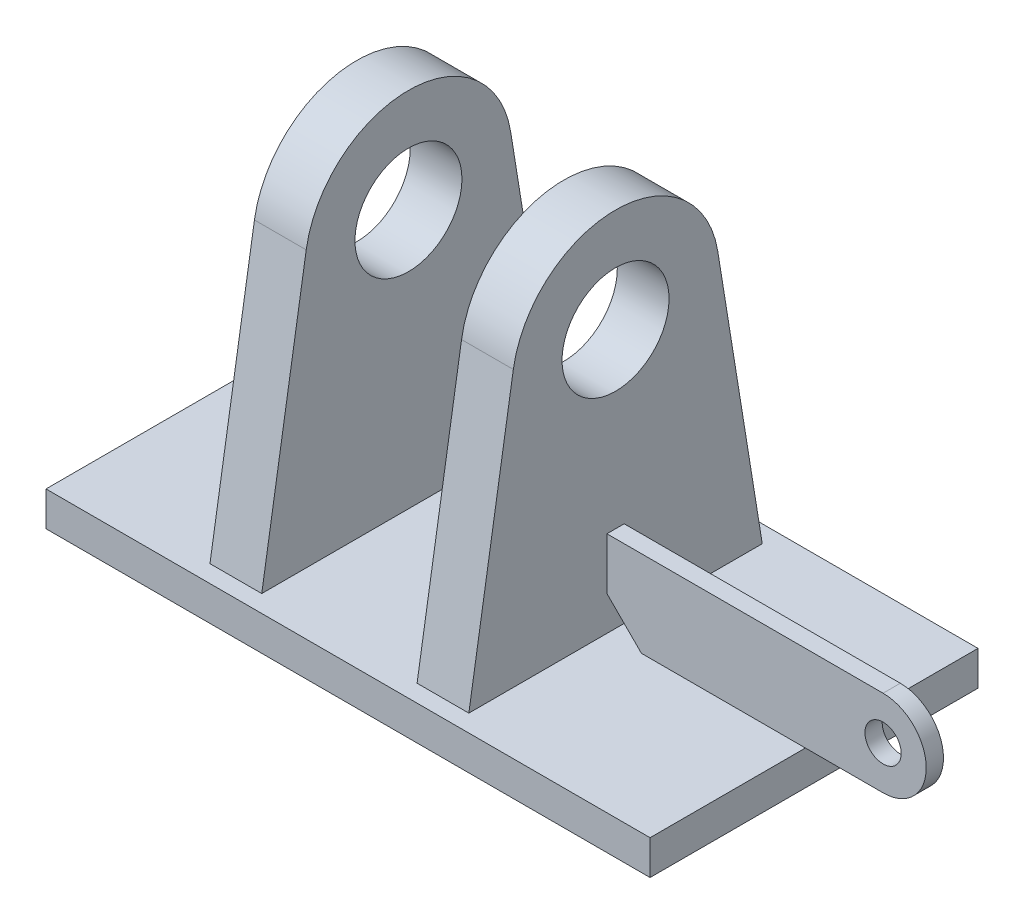
ISO-10303-21;
HEADER;
FILE_DESCRIPTION(('STEP AP214'),'2;1');
FILE_NAME('part.step','',(''),(''),'','','');
FILE_SCHEMA(('AUTOMOTIVE_DESIGN { 1 0 10303 214 1 1 1 1 }'));
ENDSEC;
DATA;
#1=APPLICATION_CONTEXT('core data for automotive mechanical design processes');
#2=APPLICATION_PROTOCOL_DEFINITION('international standard','automotive_design',2000,#1);
#3=PRODUCT_CONTEXT('',#1,'mechanical');
#4=PRODUCT('Part','Part','',(#3));
#5=PRODUCT_RELATED_PRODUCT_CATEGORY('part','',(#4));
#6=PRODUCT_DEFINITION_FORMATION('','',#4);
#7=PRODUCT_DEFINITION_CONTEXT('part definition',#1,'design');
#8=PRODUCT_DEFINITION('design','',#6,#7);
#9=PRODUCT_DEFINITION_SHAPE('','',#8);
#10=(LENGTH_UNIT() NAMED_UNIT(*) SI_UNIT(.MILLI.,.METRE.));
#11=(NAMED_UNIT(*) PLANE_ANGLE_UNIT() SI_UNIT($,.RADIAN.));
#12=(NAMED_UNIT(*) SI_UNIT($,.STERADIAN.) SOLID_ANGLE_UNIT());
#13=UNCERTAINTY_MEASURE_WITH_UNIT(LENGTH_MEASURE(1.E-05),#10,'distance_accuracy_value','');
#14=(GEOMETRIC_REPRESENTATION_CONTEXT(3) GLOBAL_UNCERTAINTY_ASSIGNED_CONTEXT((#13)) GLOBAL_UNIT_ASSIGNED_CONTEXT((#10,
#11,#12)) REPRESENTATION_CONTEXT('',''));
#15=CARTESIAN_POINT('',(0.,0.,0.));
#16=DIRECTION('',(0.,0.,1.));
#17=DIRECTION('',(1.,0.,0.));
#18=AXIS2_PLACEMENT_3D('',#15,#16,#17);
#19=CARTESIAN_POINT('',(235.,20.,-100.));
#20=DIRECTION('',(-1.,0.,0.));
#21=DIRECTION('',(0.,0.,1.));
#22=AXIS2_PLACEMENT_3D('',#19,#20,#21);
#23=PLANE('',#22);
#24=DIRECTION('',(0.,-1.,0.));
#25=VECTOR('',#24,1.);
#26=CARTESIAN_POINT('',(235.,20.,-90.));
#27=LINE('',#26,#25);
#28=CARTESIAN_POINT('',(235.,50.,-90.));
#29=VERTEX_POINT('',#28);
#30=CARTESIAN_POINT('',(235.,20.,-90.));
#31=VERTEX_POINT('',#30);
#32=EDGE_CURVE('E131',#29,#31,#27,.T.);
#33=ORIENTED_EDGE('',*,*,#32,.F.);
#34=DIRECTION('',(0.,0.,1.));
#35=VECTOR('',#34,1.);
#36=CARTESIAN_POINT('',(235.,50.,-100.));
#37=LINE('',#36,#35);
#38=CARTESIAN_POINT('',(235.,50.,-100.));
#39=VERTEX_POINT('',#38);
#40=EDGE_CURVE('E12',#39,#29,#37,.T.);
#41=ORIENTED_EDGE('',*,*,#40,.F.);
#42=DIRECTION('',(0.,-1.,0.));
#43=VECTOR('',#42,1.);
#44=CARTESIAN_POINT('',(235.,20.,-100.));
#45=LINE('',#44,#43);
#46=CARTESIAN_POINT('',(235.,20.,-100.));
#47=VERTEX_POINT('',#46);
#48=EDGE_CURVE('E126',#39,#47,#45,.T.);
#49=ORIENTED_EDGE('',*,*,#48,.T.);
#50=DIRECTION('',(0.,0.,1.));
#51=VECTOR('',#50,1.);
#52=CARTESIAN_POINT('',(235.,20.,-100.));
#53=LINE('',#52,#51);
#54=EDGE_CURVE('E57',#47,#31,#53,.T.);
#55=ORIENTED_EDGE('',*,*,#54,.T.);
#56=EDGE_LOOP('',(#33,#41,#49,#55));
#57=FACE_BOUND('',#56,.T.);
#58=ADVANCED_FACE('F54',(#57),#23,.T.);
#59=CARTESIAN_POINT('',(235.,50.,-100.));
#60=DIRECTION('',(0.,1.,0.));
#61=DIRECTION('',(0.,0.,1.));
#62=AXIS2_PLACEMENT_3D('',#59,#60,#61);
#63=PLANE('',#62);
#64=DIRECTION('',(-1.,0.,0.));
#65=VECTOR('',#64,1.);
#66=CARTESIAN_POINT('',(235.,50.,-90.));
#67=LINE('',#66,#65);
#68=CARTESIAN_POINT('',(395.,50.,-90.));
#69=VERTEX_POINT('',#68);
#70=EDGE_CURVE('E141',#69,#29,#67,.T.);
#71=ORIENTED_EDGE('',*,*,#70,.F.);
#72=DIRECTION('',(0.,0.,1.));
#73=VECTOR('',#72,1.);
#74=CARTESIAN_POINT('',(395.,50.,-100.));
#75=LINE('',#74,#73);
#76=CARTESIAN_POINT('',(395.,50.,-100.));
#77=VERTEX_POINT('',#76);
#78=EDGE_CURVE('E63',#77,#69,#75,.T.);
#79=ORIENTED_EDGE('',*,*,#78,.F.);
#80=DIRECTION('',(-1.,0.,0.));
#81=VECTOR('',#80,1.);
#82=CARTESIAN_POINT('',(235.,50.,-100.));
#83=LINE('',#82,#81);
#84=EDGE_CURVE('E121',#77,#39,#83,.T.);
#85=ORIENTED_EDGE('',*,*,#84,.T.);
#86=ORIENTED_EDGE('',*,*,#40,.T.);
#87=EDGE_LOOP('',(#71,#79,#85,#86));
#88=FACE_BOUND('',#87,.T.);
#89=ADVANCED_FACE('F147',(#88),#63,.T.);
#90=CARTESIAN_POINT('',(395.,25.,-100.));
#91=DIRECTION('',(0.,0.,1.));
#92=DIRECTION('',(1.,0.,0.));
#93=AXIS2_PLACEMENT_3D('',#90,#91,#92);
#94=CYLINDRICAL_SURFACE('',#93,25.);
#95=CARTESIAN_POINT('',(395.,25.,-90.));
#96=DIRECTION('',(0.,0.,1.));
#97=DIRECTION('',(1.,0.,0.));
#98=AXIS2_PLACEMENT_3D('',#95,#96,#97);
#99=CIRCLE('',#98,25.);
#100=CARTESIAN_POINT('',(395.,0.,-90.));
#101=VERTEX_POINT('',#100);
#102=EDGE_CURVE('E110',#101,#69,#99,.T.);
#103=ORIENTED_EDGE('',*,*,#102,.F.);
#104=DIRECTION('',(0.,0.,1.));
#105=VECTOR('',#104,1.);
#106=CARTESIAN_POINT('',(395.,0.,-100.));
#107=LINE('',#106,#105);
#108=CARTESIAN_POINT('',(395.,0.,-100.));
#109=VERTEX_POINT('',#108);
#110=EDGE_CURVE('E105',#109,#101,#107,.T.);
#111=ORIENTED_EDGE('',*,*,#110,.F.);
#112=CARTESIAN_POINT('',(395.,25.,-100.));
#113=DIRECTION('',(0.,0.,1.));
#114=DIRECTION('',(1.,0.,0.));
#115=AXIS2_PLACEMENT_3D('',#112,#113,#114);
#116=CIRCLE('',#115,25.);
#117=EDGE_CURVE('E108',#109,#77,#116,.T.);
#118=ORIENTED_EDGE('',*,*,#117,.T.);
#119=ORIENTED_EDGE('',*,*,#78,.T.);
#120=EDGE_LOOP('',(#103,#111,#118,#119));
#121=FACE_BOUND('',#120,.T.);
#122=ADVANCED_FACE('F107',(#121),#94,.T.);
#123=CARTESIAN_POINT('',(395.,0.,-100.));
#124=DIRECTION('',(0.,-1.,0.));
#125=DIRECTION('',(1.,0.,0.));
#126=AXIS2_PLACEMENT_3D('',#123,#124,#125);
#127=PLANE('',#126);
#128=DIRECTION('',(1.,0.,0.));
#129=VECTOR('',#128,1.);
#130=CARTESIAN_POINT('',(395.,0.,-90.));
#131=LINE('',#130,#129);
#132=CARTESIAN_POINT('',(255.,0.,-90.));
#133=VERTEX_POINT('',#132);
#134=EDGE_CURVE('E138',#133,#101,#131,.T.);
#135=ORIENTED_EDGE('',*,*,#134,.F.);
#136=DIRECTION('',(0.,0.,1.));
#137=VECTOR('',#136,1.);
#138=CARTESIAN_POINT('',(255.,0.,-100.));
#139=LINE('',#138,#137);
#140=CARTESIAN_POINT('',(255.,0.,-100.));
#141=VERTEX_POINT('',#140);
#142=EDGE_CURVE('E115',#141,#133,#139,.T.);
#143=ORIENTED_EDGE('',*,*,#142,.F.);
#144=DIRECTION('',(1.,0.,0.));
#145=VECTOR('',#144,1.);
#146=CARTESIAN_POINT('',(395.,0.,-100.));
#147=LINE('',#146,#145);
#148=EDGE_CURVE('E120',#141,#109,#147,.T.);
#149=ORIENTED_EDGE('',*,*,#148,.T.);
#150=ORIENTED_EDGE('',*,*,#110,.T.);
#151=EDGE_LOOP('',(#135,#143,#149,#150));
#152=FACE_BOUND('',#151,.T.);
#153=ADVANCED_FACE('F123',(#152),#127,.T.);
#154=CARTESIAN_POINT('',(255.,0.,-100.));
#155=DIRECTION('',(-0.707106781186547,-0.707106781186548,0.));
#156=DIRECTION('',(0.707106781186548,-0.707106781186547,0.));
#157=AXIS2_PLACEMENT_3D('',#154,#155,#156);
#158=PLANE('',#157);
#159=DIRECTION('',(0.707106781186548,-0.707106781186547,0.));
#160=VECTOR('',#159,1.);
#161=CARTESIAN_POINT('',(255.,0.,-90.));
#162=LINE('',#161,#160);
#163=EDGE_CURVE('E134',#31,#133,#162,.T.);
#164=ORIENTED_EDGE('',*,*,#163,.F.);
#165=ORIENTED_EDGE('',*,*,#54,.F.);
#166=DIRECTION('',(0.707106781186548,-0.707106781186547,0.));
#167=VECTOR('',#166,1.);
#168=CARTESIAN_POINT('',(255.,0.,-100.));
#169=LINE('',#168,#167);
#170=EDGE_CURVE('E124',#47,#141,#169,.T.);
#171=ORIENTED_EDGE('',*,*,#170,.T.);
#172=ORIENTED_EDGE('',*,*,#142,.T.);
#173=EDGE_LOOP('',(#164,#165,#171,#172));
#174=FACE_BOUND('',#173,.T.);
#175=ADVANCED_FACE('F144',(#174),#158,.T.);
#176=CARTESIAN_POINT('',(395.,25.,-100.));
#177=DIRECTION('',(0.,0.,1.));
#178=DIRECTION('',(1.,0.,0.));
#179=AXIS2_PLACEMENT_3D('',#176,#177,#178);
#180=PLANE('',#179);
#181=CARTESIAN_POINT('',(395.,25.,-100.));
#182=DIRECTION('',(0.,0.,1.));
#183=DIRECTION('',(1.,0.,0.));
#184=AXIS2_PLACEMENT_3D('',#181,#182,#183);
#185=CIRCLE('',#184,10.5);
#186=CARTESIAN_POINT('',(405.5,25.,-100.));
#187=VERTEX_POINT('',#186);
#188=EDGE_CURVE('E135',#187,#187,#185,.T.);
#189=ORIENTED_EDGE('',*,*,#188,.T.);
#190=EDGE_LOOP('',(#189));
#191=FACE_BOUND('',#190,.T.);
#192=ORIENTED_EDGE('',*,*,#48,.F.);
#193=ORIENTED_EDGE('',*,*,#84,.F.);
#194=ORIENTED_EDGE('',*,*,#117,.F.);
#195=ORIENTED_EDGE('',*,*,#148,.F.);
#196=ORIENTED_EDGE('',*,*,#170,.F.);
#197=EDGE_LOOP('',(#192,#193,#194,#195,#196));
#198=FACE_BOUND('',#197,.T.);
#199=ADVANCED_FACE('F119',(#191,#198),#180,.F.);
#200=CARTESIAN_POINT('',(395.,25.,-90.));
#201=DIRECTION('',(0.,0.,1.));
#202=DIRECTION('',(1.,0.,0.));
#203=AXIS2_PLACEMENT_3D('',#200,#201,#202);
#204=PLANE('',#203);
#205=CARTESIAN_POINT('',(395.,25.,-90.));
#206=DIRECTION('',(0.,0.,1.));
#207=DIRECTION('',(1.,0.,0.));
#208=AXIS2_PLACEMENT_3D('',#205,#206,#207);
#209=CIRCLE('',#208,10.5);
#210=CARTESIAN_POINT('',(405.5,25.,-90.));
#211=VERTEX_POINT('',#210);
#212=EDGE_CURVE('E179',#211,#211,#209,.T.);
#213=ORIENTED_EDGE('',*,*,#212,.F.);
#214=EDGE_LOOP('',(#213));
#215=FACE_BOUND('',#214,.T.);
#216=ORIENTED_EDGE('',*,*,#32,.T.);
#217=ORIENTED_EDGE('',*,*,#163,.T.);
#218=ORIENTED_EDGE('',*,*,#134,.T.);
#219=ORIENTED_EDGE('',*,*,#102,.T.);
#220=ORIENTED_EDGE('',*,*,#70,.T.);
#221=EDGE_LOOP('',(#216,#217,#218,#219,#220));
#222=FACE_BOUND('',#221,.T.);
#223=ADVANCED_FACE('F146',(#215,#222),#204,.T.);
#224=CARTESIAN_POINT('',(395.,25.,-100.));
#225=DIRECTION('',(0.,0.,1.));
#226=DIRECTION('',(1.,0.,0.));
#227=AXIS2_PLACEMENT_3D('',#224,#225,#226);
#228=CYLINDRICAL_SURFACE('',#227,10.5);
#229=ORIENTED_EDGE('',*,*,#188,.F.);
#230=EDGE_LOOP('',(#229));
#231=FACE_BOUND('',#230,.T.);
#232=ORIENTED_EDGE('',*,*,#212,.T.);
#233=EDGE_LOOP('',(#232));
#234=FACE_BOUND('',#233,.T.);
#235=ADVANCED_FACE('F167',(#231,#234),#228,.F.);
#236=CLOSED_SHELL('',(#58,#89,#122,#153,#175,#199,#223,#235));
#237=MANIFOLD_SOLID_BREP('B2',#236);
#238=CARTESIAN_POINT('',(235.,159.565171526913,-35.767344364272));
#239=DIRECTION('',(0.,-0.159419525448542,-0.987210927262134));
#240=DIRECTION('',(0.,0.987210927262134,-0.159419525448542));
#241=AXIS2_PLACEMENT_3D('',#238,#239,#240);
#242=PLANE('',#241);
#243=DIRECTION('',(0.,-0.987210927262134,0.159419525448542));
#244=VECTOR('',#243,1.);
#245=CARTESIAN_POINT('',(205.,159.565171526913,-35.767344364272));
#246=LINE('',#245,#244);
#247=CARTESIAN_POINT('',(205.,159.565171526913,-35.767344364272));
#248=VERTEX_POINT('',#247);
#249=CARTESIAN_POINT('',(205.,0.,-10.));
#250=VERTEX_POINT('',#249);
#251=EDGE_CURVE('E316',#248,#250,#246,.T.);
#252=ORIENTED_EDGE('',*,*,#251,.T.);
#253=DIRECTION('',(-1.,0.,0.));
#254=VECTOR('',#253,1.);
#255=CARTESIAN_POINT('',(235.,0.,-10.));
#256=LINE('',#255,#254);
#257=CARTESIAN_POINT('',(235.,0.,-10.));
#258=VERTEX_POINT('',#257);
#259=EDGE_CURVE('E52',#258,#250,#256,.T.);
#260=ORIENTED_EDGE('',*,*,#259,.F.);
#261=DIRECTION('',(0.,-0.987210927262134,0.159419525448542));
#262=VECTOR('',#261,1.);
#263=CARTESIAN_POINT('',(235.,159.565171526913,-35.767344364272));
#264=LINE('',#263,#262);
#265=CARTESIAN_POINT('',(235.,159.565171526913,-35.767344364272));
#266=VERTEX_POINT('',#265);
#267=EDGE_CURVE('E303',#266,#258,#264,.T.);
#268=ORIENTED_EDGE('',*,*,#267,.F.);
#269=DIRECTION('',(-1.,0.,0.));
#270=VECTOR('',#269,1.);
#271=CARTESIAN_POINT('',(235.,159.565171526913,-35.767344364272));
#272=LINE('',#271,#270);
#273=EDGE_CURVE('E312',#266,#248,#272,.T.);
#274=ORIENTED_EDGE('',*,*,#273,.T.);
#275=EDGE_LOOP('',(#252,#260,#268,#274));
#276=FACE_BOUND('',#275,.T.);
#277=ADVANCED_FACE('F251',(#276),#242,.F.);
#278=CARTESIAN_POINT('',(235.,0.,-10.));
#279=DIRECTION('',(0.,1.,0.));
#280=DIRECTION('',(0.,0.,1.));
#281=AXIS2_PLACEMENT_3D('',#278,#279,#280);
#282=PLANE('',#281);
#283=DIRECTION('',(0.,0.,-1.));
#284=VECTOR('',#283,1.);
#285=CARTESIAN_POINT('',(205.,0.,-10.));
#286=LINE('',#285,#284);
#287=CARTESIAN_POINT('',(205.,0.,-180.));
#288=VERTEX_POINT('',#287);
#289=EDGE_CURVE('E307',#250,#288,#286,.T.);
#290=ORIENTED_EDGE('',*,*,#289,.T.);
#291=DIRECTION('',(-1.,0.,0.));
#292=VECTOR('',#291,1.);
#293=CARTESIAN_POINT('',(235.,0.,-180.));
#294=LINE('',#293,#292);
#295=CARTESIAN_POINT('',(235.,0.,-180.));
#296=VERTEX_POINT('',#295);
#297=EDGE_CURVE('E260',#296,#288,#294,.T.);
#298=ORIENTED_EDGE('',*,*,#297,.F.);
#299=DIRECTION('',(0.,0.,-1.));
#300=VECTOR('',#299,1.);
#301=CARTESIAN_POINT('',(235.,0.,-10.));
#302=LINE('',#301,#300);
#303=EDGE_CURVE('E298',#258,#296,#302,.T.);
#304=ORIENTED_EDGE('',*,*,#303,.F.);
#305=ORIENTED_EDGE('',*,*,#259,.T.);
#306=EDGE_LOOP('',(#290,#298,#304,#305));
#307=FACE_BOUND('',#306,.T.);
#308=ADVANCED_FACE('F306',(#307),#282,.F.);
#309=CARTESIAN_POINT('',(235.,0.,-180.));
#310=DIRECTION('',(0.,-0.159419525448542,0.987210927262134));
#311=DIRECTION('',(0.,-0.987210927262134,-0.159419525448542));
#312=AXIS2_PLACEMENT_3D('',#309,#310,#311);
#313=PLANE('',#312);
#314=DIRECTION('',(0.,0.987210927262134,0.159419525448542));
#315=VECTOR('',#314,1.);
#316=CARTESIAN_POINT('',(205.,0.,-180.));
#317=LINE('',#316,#315);
#318=CARTESIAN_POINT('',(205.,159.565171526913,-154.232655635728));
#319=VERTEX_POINT('',#318);
#320=EDGE_CURVE('E285',#288,#319,#317,.T.);
#321=ORIENTED_EDGE('',*,*,#320,.T.);
#322=DIRECTION('',(-1.,0.,0.));
#323=VECTOR('',#322,1.);
#324=CARTESIAN_POINT('',(235.,159.565171526913,-154.232655635728));
#325=LINE('',#324,#323);
#326=CARTESIAN_POINT('',(235.,159.565171526913,-154.232655635728));
#327=VERTEX_POINT('',#326);
#328=EDGE_CURVE('E308',#327,#319,#325,.T.);
#329=ORIENTED_EDGE('',*,*,#328,.F.);
#330=DIRECTION('',(0.,0.987210927262134,0.159419525448542));
#331=VECTOR('',#330,1.);
#332=CARTESIAN_POINT('',(235.,0.,-180.));
#333=LINE('',#332,#331);
#334=EDGE_CURVE('E301',#296,#327,#333,.T.);
#335=ORIENTED_EDGE('',*,*,#334,.F.);
#336=ORIENTED_EDGE('',*,*,#297,.T.);
#337=EDGE_LOOP('',(#321,#329,#335,#336));
#338=FACE_BOUND('',#337,.T.);
#339=ADVANCED_FACE('F310',(#338),#313,.F.);
#340=CARTESIAN_POINT('',(235.,150.,-95.));
#341=DIRECTION('',(-1.,0.,0.));
#342=DIRECTION('',(0.,0.,1.));
#343=AXIS2_PLACEMENT_3D('',#340,#341,#342);
#344=CYLINDRICAL_SURFACE('',#343,60.);
#345=CARTESIAN_POINT('',(205.,150.,-95.));
#346=DIRECTION('',(1.,0.,0.));
#347=DIRECTION('',(0.,0.,-1.));
#348=AXIS2_PLACEMENT_3D('',#345,#346,#347);
#349=CIRCLE('',#348,60.);
#350=EDGE_CURVE('E291',#319,#248,#349,.T.);
#351=ORIENTED_EDGE('',*,*,#350,.T.);
#352=ORIENTED_EDGE('',*,*,#273,.F.);
#353=CARTESIAN_POINT('',(235.,150.,-95.));
#354=DIRECTION('',(1.,0.,0.));
#355=DIRECTION('',(0.,0.,-1.));
#356=AXIS2_PLACEMENT_3D('',#353,#354,#355);
#357=CIRCLE('',#356,60.);
#358=EDGE_CURVE('E268',#327,#266,#357,.T.);
#359=ORIENTED_EDGE('',*,*,#358,.F.);
#360=ORIENTED_EDGE('',*,*,#328,.T.);
#361=EDGE_LOOP('',(#351,#352,#359,#360));
#362=FACE_BOUND('',#361,.T.);
#363=ADVANCED_FACE('F324',(#362),#344,.T.);
#364=CARTESIAN_POINT('',(235.,150.,-95.));
#365=DIRECTION('',(1.,0.,0.));
#366=DIRECTION('',(0.,0.,-1.));
#367=AXIS2_PLACEMENT_3D('',#364,#365,#366);
#368=PLANE('',#367);
#369=CARTESIAN_POINT('',(235.,150.,-95.));
#370=DIRECTION('',(1.,0.,0.));
#371=DIRECTION('',(0.,0.,-1.));
#372=AXIS2_PLACEMENT_3D('',#369,#370,#371);
#373=CIRCLE('',#372,31.);
#374=CARTESIAN_POINT('',(235.,150.,-126.));
#375=VERTEX_POINT('',#374);
#376=EDGE_CURVE('E330',#375,#375,#373,.T.);
#377=ORIENTED_EDGE('',*,*,#376,.F.);
#378=EDGE_LOOP('',(#377));
#379=FACE_BOUND('',#378,.T.);
#380=ORIENTED_EDGE('',*,*,#267,.T.);
#381=ORIENTED_EDGE('',*,*,#303,.T.);
#382=ORIENTED_EDGE('',*,*,#334,.T.);
#383=ORIENTED_EDGE('',*,*,#358,.T.);
#384=EDGE_LOOP('',(#380,#381,#382,#383));
#385=FACE_BOUND('',#384,.T.);
#386=ADVANCED_FACE('F299',(#379,#385),#368,.T.);
#387=CARTESIAN_POINT('',(205.,150.,-95.));
#388=DIRECTION('',(1.,0.,0.));
#389=DIRECTION('',(0.,0.,-1.));
#390=AXIS2_PLACEMENT_3D('',#387,#388,#389);
#391=PLANE('',#390);
#392=CARTESIAN_POINT('',(205.,150.,-95.));
#393=DIRECTION('',(1.,0.,0.));
#394=DIRECTION('',(0.,0.,-1.));
#395=AXIS2_PLACEMENT_3D('',#392,#393,#394);
#396=CIRCLE('',#395,31.);
#397=CARTESIAN_POINT('',(205.,150.,-126.));
#398=VERTEX_POINT('',#397);
#399=EDGE_CURVE('E254',#398,#398,#396,.T.);
#400=ORIENTED_EDGE('',*,*,#399,.T.);
#401=EDGE_LOOP('',(#400));
#402=FACE_BOUND('',#401,.T.);
#403=ORIENTED_EDGE('',*,*,#251,.F.);
#404=ORIENTED_EDGE('',*,*,#350,.F.);
#405=ORIENTED_EDGE('',*,*,#320,.F.);
#406=ORIENTED_EDGE('',*,*,#289,.F.);
#407=EDGE_LOOP('',(#403,#404,#405,#406));
#408=FACE_BOUND('',#407,.T.);
#409=ADVANCED_FACE('F327',(#402,#408),#391,.F.);
#410=CARTESIAN_POINT('',(0.,150.,-95.));
#411=DIRECTION('',(1.,0.,0.));
#412=DIRECTION('',(0.,0.,-1.));
#413=AXIS2_PLACEMENT_3D('',#410,#411,#412);
#414=CYLINDRICAL_SURFACE('',#413,31.);
#415=ORIENTED_EDGE('',*,*,#376,.T.);
#416=EDGE_LOOP('',(#415));
#417=FACE_BOUND('',#416,.T.);
#418=ORIENTED_EDGE('',*,*,#399,.F.);
#419=EDGE_LOOP('',(#418));
#420=FACE_BOUND('',#419,.T.);
#421=ADVANCED_FACE('F339',(#417,#420),#414,.F.);
#422=CLOSED_SHELL('',(#277,#308,#339,#363,#386,#409,#421));
#423=MANIFOLD_SOLID_BREP('B6',#422);
#424=CARTESIAN_POINT('',(115.,0.,-10.));
#425=DIRECTION('',(0.,-1.,0.));
#426=DIRECTION('',(0.,0.,-1.));
#427=AXIS2_PLACEMENT_3D('',#424,#425,#426);
#428=PLANE('',#427);
#429=DIRECTION('',(0.,0.,1.));
#430=VECTOR('',#429,1.);
#431=CARTESIAN_POINT('',(85.,0.,-10.));
#432=LINE('',#431,#430);
#433=CARTESIAN_POINT('',(85.,0.,-180.));
#434=VERTEX_POINT('',#433);
#435=CARTESIAN_POINT('',(85.,0.,-10.));
#436=VERTEX_POINT('',#435);
#437=EDGE_CURVE('E488',#434,#436,#432,.T.);
#438=ORIENTED_EDGE('',*,*,#437,.F.);
#439=DIRECTION('',(-1.,0.,0.));
#440=VECTOR('',#439,1.);
#441=CARTESIAN_POINT('',(115.,0.,-180.));
#442=LINE('',#441,#440);
#443=CARTESIAN_POINT('',(115.,0.,-180.));
#444=VERTEX_POINT('',#443);
#445=EDGE_CURVE('E249',#444,#434,#442,.T.);
#446=ORIENTED_EDGE('',*,*,#445,.F.);
#447=DIRECTION('',(0.,0.,1.));
#448=VECTOR('',#447,1.);
#449=CARTESIAN_POINT('',(115.,0.,-10.));
#450=LINE('',#449,#448);
#451=CARTESIAN_POINT('',(115.,0.,-10.));
#452=VERTEX_POINT('',#451);
#453=EDGE_CURVE('E481',#444,#452,#450,.T.);
#454=ORIENTED_EDGE('',*,*,#453,.T.);
#455=DIRECTION('',(-1.,0.,0.));
#456=VECTOR('',#455,1.);
#457=CARTESIAN_POINT('',(115.,0.,-10.));
#458=LINE('',#457,#456);
#459=EDGE_CURVE('E464',#452,#436,#458,.T.);
#460=ORIENTED_EDGE('',*,*,#459,.T.);
#461=EDGE_LOOP('',(#438,#446,#454,#460));
#462=FACE_BOUND('',#461,.T.);
#463=ADVANCED_FACE('F421',(#462),#428,.T.);
#464=CARTESIAN_POINT('',(115.,0.,-180.));
#465=DIRECTION('',(0.,0.159419525448542,-0.987210927262134));
#466=DIRECTION('',(0.,0.987210927262134,0.159419525448542));
#467=AXIS2_PLACEMENT_3D('',#464,#465,#466);
#468=PLANE('',#467);
#469=DIRECTION('',(0.,-0.987210927262134,-0.159419525448542));
#470=VECTOR('',#469,1.);
#471=CARTESIAN_POINT('',(85.,0.,-180.));
#472=LINE('',#471,#470);
#473=CARTESIAN_POINT('',(85.,159.565171526913,-154.232655635728));
#474=VERTEX_POINT('',#473);
#475=EDGE_CURVE('E483',#474,#434,#472,.T.);
#476=ORIENTED_EDGE('',*,*,#475,.F.);
#477=DIRECTION('',(-1.,0.,0.));
#478=VECTOR('',#477,1.);
#479=CARTESIAN_POINT('',(115.,159.565171526913,-154.232655635728));
#480=LINE('',#479,#478);
#481=CARTESIAN_POINT('',(115.,159.565171526913,-154.232655635728));
#482=VERTEX_POINT('',#481);
#483=EDGE_CURVE('E430',#482,#474,#480,.T.);
#484=ORIENTED_EDGE('',*,*,#483,.F.);
#485=DIRECTION('',(0.,-0.987210927262134,-0.159419525448542));
#486=VECTOR('',#485,1.);
#487=CARTESIAN_POINT('',(115.,0.,-180.));
#488=LINE('',#487,#486);
#489=EDGE_CURVE('E478',#482,#444,#488,.T.);
#490=ORIENTED_EDGE('',*,*,#489,.T.);
#491=ORIENTED_EDGE('',*,*,#445,.T.);
#492=EDGE_LOOP('',(#476,#484,#490,#491));
#493=FACE_BOUND('',#492,.T.);
#494=ADVANCED_FACE('F499',(#493),#468,.T.);
#495=CARTESIAN_POINT('',(115.,150.,-95.));
#496=DIRECTION('',(-1.,0.,0.));
#497=DIRECTION('',(0.,0.,1.));
#498=AXIS2_PLACEMENT_3D('',#495,#496,#497);
#499=CYLINDRICAL_SURFACE('',#498,60.);
#500=CARTESIAN_POINT('',(85.,150.,-95.));
#501=DIRECTION('',(-1.,0.,0.));
#502=DIRECTION('',(0.,0.,-1.));
#503=AXIS2_PLACEMENT_3D('',#500,#501,#502);
#504=CIRCLE('',#503,60.);
#505=CARTESIAN_POINT('',(85.,159.565171526913,-35.767344364272));
#506=VERTEX_POINT('',#505);
#507=EDGE_CURVE('E472',#506,#474,#504,.T.);
#508=ORIENTED_EDGE('',*,*,#507,.F.);
#509=DIRECTION('',(-1.,0.,0.));
#510=VECTOR('',#509,1.);
#511=CARTESIAN_POINT('',(115.,159.565171526913,-35.767344364272));
#512=LINE('',#511,#510);
#513=CARTESIAN_POINT('',(115.,159.565171526913,-35.767344364272));
#514=VERTEX_POINT('',#513);
#515=EDGE_CURVE('E467',#514,#506,#512,.T.);
#516=ORIENTED_EDGE('',*,*,#515,.F.);
#517=CARTESIAN_POINT('',(115.,150.,-95.));
#518=DIRECTION('',(-1.,0.,0.));
#519=DIRECTION('',(0.,0.,-1.));
#520=AXIS2_PLACEMENT_3D('',#517,#518,#519);
#521=CIRCLE('',#520,60.);
#522=EDGE_CURVE('E470',#514,#482,#521,.T.);
#523=ORIENTED_EDGE('',*,*,#522,.T.);
#524=ORIENTED_EDGE('',*,*,#483,.T.);
#525=EDGE_LOOP('',(#508,#516,#523,#524));
#526=FACE_BOUND('',#525,.T.);
#527=ADVANCED_FACE('F469',(#526),#499,.T.);
#528=CARTESIAN_POINT('',(115.,159.565171526913,-35.767344364272));
#529=DIRECTION('',(0.,0.159419525448542,0.987210927262134));
#530=DIRECTION('',(0.,-0.987210927262134,0.159419525448542));
#531=AXIS2_PLACEMENT_3D('',#528,#529,#530);
#532=PLANE('',#531);
#533=DIRECTION('',(0.,0.987210927262134,-0.159419525448542));
#534=VECTOR('',#533,1.);
#535=CARTESIAN_POINT('',(85.,159.565171526913,-35.767344364272));
#536=LINE('',#535,#534);
#537=EDGE_CURVE('E491',#436,#506,#536,.T.);
#538=ORIENTED_EDGE('',*,*,#537,.F.);
#539=ORIENTED_EDGE('',*,*,#459,.F.);
#540=DIRECTION('',(0.,0.987210927262134,-0.159419525448542));
#541=VECTOR('',#540,1.);
#542=CARTESIAN_POINT('',(115.,159.565171526913,-35.767344364272));
#543=LINE('',#542,#541);
#544=EDGE_CURVE('E477',#452,#514,#543,.T.);
#545=ORIENTED_EDGE('',*,*,#544,.T.);
#546=ORIENTED_EDGE('',*,*,#515,.T.);
#547=EDGE_LOOP('',(#538,#539,#545,#546));
#548=FACE_BOUND('',#547,.T.);
#549=ADVANCED_FACE('F480',(#548),#532,.T.);
#550=CARTESIAN_POINT('',(115.,150.,-95.));
#551=DIRECTION('',(1.,0.,0.));
#552=DIRECTION('',(0.,0.,-1.));
#553=AXIS2_PLACEMENT_3D('',#550,#551,#552);
#554=PLANE('',#553);
#555=CARTESIAN_POINT('',(115.,150.,-95.));
#556=DIRECTION('',(1.,0.,0.));
#557=DIRECTION('',(0.,0.,-1.));
#558=AXIS2_PLACEMENT_3D('',#555,#556,#557);
#559=CIRCLE('',#558,31.);
#560=CARTESIAN_POINT('',(115.,150.,-126.));
#561=VERTEX_POINT('',#560);
#562=EDGE_CURVE('E492',#561,#561,#559,.T.);
#563=ORIENTED_EDGE('',*,*,#562,.F.);
#564=EDGE_LOOP('',(#563));
#565=FACE_BOUND('',#564,.T.);
#566=ORIENTED_EDGE('',*,*,#453,.F.);
#567=ORIENTED_EDGE('',*,*,#489,.F.);
#568=ORIENTED_EDGE('',*,*,#522,.F.);
#569=ORIENTED_EDGE('',*,*,#544,.F.);
#570=EDGE_LOOP('',(#566,#567,#568,#569));
#571=FACE_BOUND('',#570,.T.);
#572=ADVANCED_FACE('F476',(#565,#571),#554,.T.);
#573=CARTESIAN_POINT('',(85.,150.,-95.));
#574=DIRECTION('',(1.,0.,0.));
#575=DIRECTION('',(0.,0.,-1.));
#576=AXIS2_PLACEMENT_3D('',#573,#574,#575);
#577=PLANE('',#576);
#578=CARTESIAN_POINT('',(85.,150.,-95.));
#579=DIRECTION('',(1.,0.,0.));
#580=DIRECTION('',(0.,0.,-1.));
#581=AXIS2_PLACEMENT_3D('',#578,#579,#580);
#582=CIRCLE('',#581,31.);
#583=CARTESIAN_POINT('',(85.,150.,-126.));
#584=VERTEX_POINT('',#583);
#585=EDGE_CURVE('E424',#584,#584,#582,.T.);
#586=ORIENTED_EDGE('',*,*,#585,.T.);
#587=EDGE_LOOP('',(#586));
#588=FACE_BOUND('',#587,.T.);
#589=ORIENTED_EDGE('',*,*,#437,.T.);
#590=ORIENTED_EDGE('',*,*,#537,.T.);
#591=ORIENTED_EDGE('',*,*,#507,.T.);
#592=ORIENTED_EDGE('',*,*,#475,.T.);
#593=EDGE_LOOP('',(#589,#590,#591,#592));
#594=FACE_BOUND('',#593,.T.);
#595=ADVANCED_FACE('F498',(#588,#594),#577,.F.);
#596=CARTESIAN_POINT('',(0.,150.,-95.));
#597=DIRECTION('',(1.,0.,0.));
#598=DIRECTION('',(0.,0.,-1.));
#599=AXIS2_PLACEMENT_3D('',#596,#597,#598);
#600=CYLINDRICAL_SURFACE('',#599,31.);
#601=ORIENTED_EDGE('',*,*,#562,.T.);
#602=EDGE_LOOP('',(#601));
#603=FACE_BOUND('',#602,.T.);
#604=ORIENTED_EDGE('',*,*,#585,.F.);
#605=EDGE_LOOP('',(#604));
#606=FACE_BOUND('',#605,.T.);
#607=ADVANCED_FACE('F517',(#603,#606),#600,.F.);
#608=CLOSED_SHELL('',(#463,#494,#527,#549,#572,#595,#607));
#609=MANIFOLD_SOLID_BREP('B46',#608);
#610=CARTESIAN_POINT('',(0.,-20.,0.));
#611=DIRECTION('',(-1.,0.,0.));
#612=DIRECTION('',(0.,0.,1.));
#613=AXIS2_PLACEMENT_3D('',#610,#611,#612);
#614=PLANE('',#613);
#615=DIRECTION('',(0.,0.,1.));
#616=VECTOR('',#615,1.);
#617=CARTESIAN_POINT('',(0.,0.,0.));
#618=LINE('',#617,#616);
#619=CARTESIAN_POINT('',(0.,0.,-190.));
#620=VERTEX_POINT('',#619);
#621=CARTESIAN_POINT('',(0.,0.,0.));
#622=VERTEX_POINT('',#621);
#623=EDGE_CURVE('E643',#620,#622,#618,.T.);
#624=ORIENTED_EDGE('',*,*,#623,.F.);
#625=DIRECTION('',(0.,1.,0.));
#626=VECTOR('',#625,1.);
#627=CARTESIAN_POINT('',(0.,-20.,-190.));
#628=LINE('',#627,#626);
#629=CARTESIAN_POINT('',(0.,-20.,-190.));
#630=VERTEX_POINT('',#629);
#631=EDGE_CURVE('E419',#630,#620,#628,.T.);
#632=ORIENTED_EDGE('',*,*,#631,.F.);
#633=DIRECTION('',(0.,0.,1.));
#634=VECTOR('',#633,1.);
#635=CARTESIAN_POINT('',(0.,-20.,0.));
#636=LINE('',#635,#634);
#637=CARTESIAN_POINT('',(0.,-20.,0.));
#638=VERTEX_POINT('',#637);
#639=EDGE_CURVE('E636',#630,#638,#636,.T.);
#640=ORIENTED_EDGE('',*,*,#639,.T.);
#641=DIRECTION('',(0.,1.,0.));
#642=VECTOR('',#641,1.);
#643=CARTESIAN_POINT('',(0.,-20.,0.));
#644=LINE('',#643,#642);
#645=EDGE_CURVE('E581',#638,#622,#644,.T.);
#646=ORIENTED_EDGE('',*,*,#645,.T.);
#647=EDGE_LOOP('',(#624,#632,#640,#646));
#648=FACE_BOUND('',#647,.T.);
#649=ADVANCED_FACE('F578',(#648),#614,.T.);
#650=CARTESIAN_POINT('',(0.,-20.,-190.));
#651=DIRECTION('',(0.,0.,-1.));
#652=DIRECTION('',(-1.,0.,0.));
#653=AXIS2_PLACEMENT_3D('',#650,#651,#652);
#654=PLANE('',#653);
#655=DIRECTION('',(-1.,0.,0.));
#656=VECTOR('',#655,1.);
#657=CARTESIAN_POINT('',(0.,0.,-190.));
#658=LINE('',#657,#656);
#659=CARTESIAN_POINT('',(350.,0.,-190.));
#660=VERTEX_POINT('',#659);
#661=EDGE_CURVE('E638',#660,#620,#658,.T.);
#662=ORIENTED_EDGE('',*,*,#661,.F.);
#663=DIRECTION('',(0.,1.,0.));
#664=VECTOR('',#663,1.);
#665=CARTESIAN_POINT('',(350.,-20.,-190.));
#666=LINE('',#665,#664);
#667=CARTESIAN_POINT('',(350.,-20.,-190.));
#668=VERTEX_POINT('',#667);
#669=EDGE_CURVE('E587',#668,#660,#666,.T.);
#670=ORIENTED_EDGE('',*,*,#669,.F.);
#671=DIRECTION('',(-1.,0.,0.));
#672=VECTOR('',#671,1.);
#673=CARTESIAN_POINT('',(0.,-20.,-190.));
#674=LINE('',#673,#672);
#675=EDGE_CURVE('E633',#668,#630,#674,.T.);
#676=ORIENTED_EDGE('',*,*,#675,.T.);
#677=ORIENTED_EDGE('',*,*,#631,.T.);
#678=EDGE_LOOP('',(#662,#670,#676,#677));
#679=FACE_BOUND('',#678,.T.);
#680=ADVANCED_FACE('F654',(#679),#654,.T.);
#681=CARTESIAN_POINT('',(350.,-20.,0.));
#682=DIRECTION('',(1.,0.,0.));
#683=DIRECTION('',(0.,0.,-1.));
#684=AXIS2_PLACEMENT_3D('',#681,#682,#683);
#685=PLANE('',#684);
#686=DIRECTION('',(0.,0.,-1.));
#687=VECTOR('',#686,1.);
#688=CARTESIAN_POINT('',(350.,0.,0.));
#689=LINE('',#688,#687);
#690=CARTESIAN_POINT('',(350.,0.,0.));
#691=VERTEX_POINT('',#690);
#692=EDGE_CURVE('E628',#691,#660,#689,.T.);
#693=ORIENTED_EDGE('',*,*,#692,.F.);
#694=DIRECTION('',(0.,1.,0.));
#695=VECTOR('',#694,1.);
#696=CARTESIAN_POINT('',(350.,-20.,0.));
#697=LINE('',#696,#695);
#698=CARTESIAN_POINT('',(350.,-20.,0.));
#699=VERTEX_POINT('',#698);
#700=EDGE_CURVE('E623',#699,#691,#697,.T.);
#701=ORIENTED_EDGE('',*,*,#700,.F.);
#702=DIRECTION('',(0.,0.,-1.));
#703=VECTOR('',#702,1.);
#704=CARTESIAN_POINT('',(350.,-20.,0.));
#705=LINE('',#704,#703);
#706=EDGE_CURVE('E626',#699,#668,#705,.T.);
#707=ORIENTED_EDGE('',*,*,#706,.T.);
#708=ORIENTED_EDGE('',*,*,#669,.T.);
#709=EDGE_LOOP('',(#693,#701,#707,#708));
#710=FACE_BOUND('',#709,.T.);
#711=ADVANCED_FACE('F625',(#710),#685,.T.);
#712=CARTESIAN_POINT('',(0.,-20.,0.));
#713=DIRECTION('',(0.,0.,1.));
#714=DIRECTION('',(1.,0.,0.));
#715=AXIS2_PLACEMENT_3D('',#712,#713,#714);
#716=PLANE('',#715);
#717=DIRECTION('',(1.,0.,0.));
#718=VECTOR('',#717,1.);
#719=CARTESIAN_POINT('',(0.,0.,0.));
#720=LINE('',#719,#718);
#721=EDGE_CURVE('E646',#622,#691,#720,.T.);
#722=ORIENTED_EDGE('',*,*,#721,.F.);
#723=ORIENTED_EDGE('',*,*,#645,.F.);
#724=DIRECTION('',(1.,0.,0.));
#725=VECTOR('',#724,1.);
#726=CARTESIAN_POINT('',(0.,-20.,0.));
#727=LINE('',#726,#725);
#728=EDGE_CURVE('E632',#638,#699,#727,.T.);
#729=ORIENTED_EDGE('',*,*,#728,.T.);
#730=ORIENTED_EDGE('',*,*,#700,.T.);
#731=EDGE_LOOP('',(#722,#723,#729,#730));
#732=FACE_BOUND('',#731,.T.);
#733=ADVANCED_FACE('F635',(#732),#716,.T.);
#734=CARTESIAN_POINT('',(0.,-20.,0.));
#735=DIRECTION('',(0.,-1.,0.));
#736=DIRECTION('',(0.,0.,-1.));
#737=AXIS2_PLACEMENT_3D('',#734,#735,#736);
#738=PLANE('',#737);
#739=CARTESIAN_POINT('',(40.,-20.,-95.));
#740=DIRECTION('',(0.,-1.,0.));
#741=DIRECTION('',(0.,0.,-1.));
#742=AXIS2_PLACEMENT_3D('',#739,#740,#741);
#743=CIRCLE('',#742,20.);
#744=CARTESIAN_POINT('',(40.,-20.,-115.));
#745=VERTEX_POINT('',#744);
#746=EDGE_CURVE('E690',#745,#745,#743,.T.);
#747=ORIENTED_EDGE('',*,*,#746,.F.);
#748=EDGE_LOOP('',(#747));
#749=FACE_BOUND('',#748,.T.);
#750=CARTESIAN_POINT('',(160.,-20.,-95.));
#751=DIRECTION('',(0.,-1.,0.));
#752=DIRECTION('',(0.,0.,-1.));
#753=AXIS2_PLACEMENT_3D('',#750,#751,#752);
#754=CIRCLE('',#753,20.);
#755=CARTESIAN_POINT('',(160.,-20.,-115.));
#756=VERTEX_POINT('',#755);
#757=EDGE_CURVE('E647',#756,#756,#754,.T.);
#758=ORIENTED_EDGE('',*,*,#757,.F.);
#759=EDGE_LOOP('',(#758));
#760=FACE_BOUND('',#759,.T.);
#761=ORIENTED_EDGE('',*,*,#639,.F.);
#762=ORIENTED_EDGE('',*,*,#675,.F.);
#763=ORIENTED_EDGE('',*,*,#706,.F.);
#764=ORIENTED_EDGE('',*,*,#728,.F.);
#765=EDGE_LOOP('',(#761,#762,#763,#764));
#766=FACE_BOUND('',#765,.T.);
#767=ADVANCED_FACE('F631',(#749,#760,#766),#738,.T.);
#768=CARTESIAN_POINT('',(0.,0.,0.));
#769=DIRECTION('',(0.,-1.,0.));
#770=DIRECTION('',(0.,0.,-1.));
#771=AXIS2_PLACEMENT_3D('',#768,#769,#770);
#772=PLANE('',#771);
#773=CARTESIAN_POINT('',(40.,0.,-95.));
#774=DIRECTION('',(0.,1.,0.));
#775=DIRECTION('',(0.,0.,1.));
#776=AXIS2_PLACEMENT_3D('',#773,#774,#775);
#777=CIRCLE('',#776,20.);
#778=CARTESIAN_POINT('',(40.,0.,-75.));
#779=VERTEX_POINT('',#778);
#780=EDGE_CURVE('E688',#779,#779,#777,.T.);
#781=ORIENTED_EDGE('',*,*,#780,.F.);
#782=EDGE_LOOP('',(#781));
#783=FACE_BOUND('',#782,.T.);
#784=CARTESIAN_POINT('',(160.,0.,-95.));
#785=DIRECTION('',(0.,1.,0.));
#786=DIRECTION('',(0.,0.,1.));
#787=AXIS2_PLACEMENT_3D('',#784,#785,#786);
#788=CIRCLE('',#787,20.);
#789=CARTESIAN_POINT('',(160.,0.,-75.));
#790=VERTEX_POINT('',#789);
#791=EDGE_CURVE('E691',#790,#790,#788,.T.);
#792=ORIENTED_EDGE('',*,*,#791,.F.);
#793=EDGE_LOOP('',(#792));
#794=FACE_BOUND('',#793,.T.);
#795=ORIENTED_EDGE('',*,*,#623,.T.);
#796=ORIENTED_EDGE('',*,*,#721,.T.);
#797=ORIENTED_EDGE('',*,*,#692,.T.);
#798=ORIENTED_EDGE('',*,*,#661,.T.);
#799=EDGE_LOOP('',(#795,#796,#797,#798));
#800=FACE_BOUND('',#799,.T.);
#801=ADVANCED_FACE('F653',(#783,#794,#800),#772,.F.);
#802=CARTESIAN_POINT('',(160.,0.,-95.));
#803=DIRECTION('',(0.,1.,0.));
#804=DIRECTION('',(0.,0.,1.));
#805=AXIS2_PLACEMENT_3D('',#802,#803,#804);
#806=CYLINDRICAL_SURFACE('',#805,20.);
#807=ORIENTED_EDGE('',*,*,#791,.T.);
#808=EDGE_LOOP('',(#807));
#809=FACE_BOUND('',#808,.T.);
#810=ORIENTED_EDGE('',*,*,#757,.T.);
#811=EDGE_LOOP('',(#810));
#812=FACE_BOUND('',#811,.T.);
#813=ADVANCED_FACE('F672',(#809,#812),#806,.F.);
#814=CARTESIAN_POINT('',(40.,0.,-95.));
#815=DIRECTION('',(0.,1.,0.));
#816=DIRECTION('',(0.,0.,1.));
#817=AXIS2_PLACEMENT_3D('',#814,#815,#816);
#818=CYLINDRICAL_SURFACE('',#817,20.);
#819=ORIENTED_EDGE('',*,*,#780,.T.);
#820=EDGE_LOOP('',(#819));
#821=FACE_BOUND('',#820,.T.);
#822=ORIENTED_EDGE('',*,*,#746,.T.);
#823=EDGE_LOOP('',(#822));
#824=FACE_BOUND('',#823,.T.);
#825=ADVANCED_FACE('F679',(#821,#824),#818,.F.);
#826=CLOSED_SHELL('',(#649,#680,#711,#733,#767,#801,#813,#825));
#827=MANIFOLD_SOLID_BREP('B243',#826);
#828=ADVANCED_BREP_SHAPE_REPRESENTATION('',(#18,#237,#423,#609,#827),#14);
#829=SHAPE_DEFINITION_REPRESENTATION(#9,#828);
ENDSEC;
END-ISO-10303-21;
